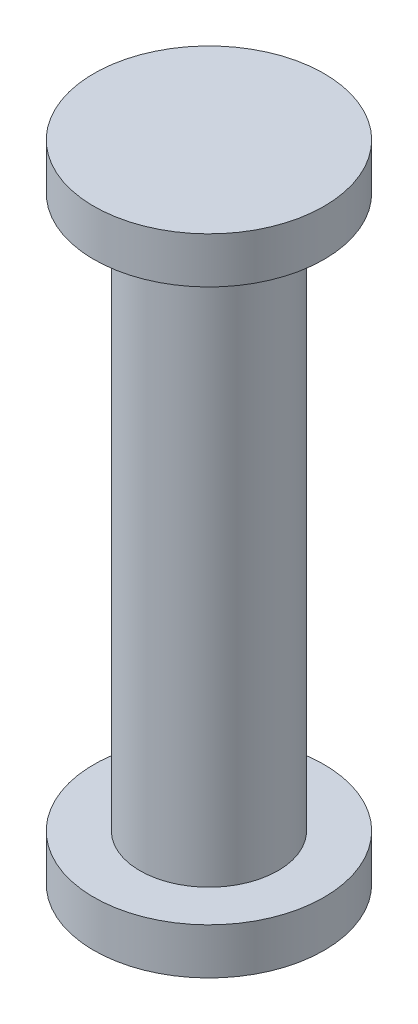
ISO-10303-21;
HEADER;
FILE_DESCRIPTION(('STEP AP214'),'2;1');
FILE_NAME('part.step','',(''),(''),'','','');
FILE_SCHEMA(('AUTOMOTIVE_DESIGN { 1 0 10303 214 1 1 1 1 }'));
ENDSEC;
DATA;
#1=APPLICATION_CONTEXT('core data for automotive mechanical design processes');
#2=APPLICATION_PROTOCOL_DEFINITION('international standard','automotive_design',2000,#1);
#3=PRODUCT_CONTEXT('',#1,'mechanical');
#4=PRODUCT('Part','Part','',(#3));
#5=PRODUCT_RELATED_PRODUCT_CATEGORY('part','',(#4));
#6=PRODUCT_DEFINITION_FORMATION('','',#4);
#7=PRODUCT_DEFINITION_CONTEXT('part definition',#1,'design');
#8=PRODUCT_DEFINITION('design','',#6,#7);
#9=PRODUCT_DEFINITION_SHAPE('','',#8);
#10=(LENGTH_UNIT() NAMED_UNIT(*) SI_UNIT(.MILLI.,.METRE.));
#11=(NAMED_UNIT(*) PLANE_ANGLE_UNIT() SI_UNIT($,.RADIAN.));
#12=(NAMED_UNIT(*) SI_UNIT($,.STERADIAN.) SOLID_ANGLE_UNIT());
#13=UNCERTAINTY_MEASURE_WITH_UNIT(LENGTH_MEASURE(1.E-05),#10,'distance_accuracy_value','');
#14=(GEOMETRIC_REPRESENTATION_CONTEXT(3) GLOBAL_UNCERTAINTY_ASSIGNED_CONTEXT((#13)) GLOBAL_UNIT_ASSIGNED_CONTEXT((#10,
#11,#12)) REPRESENTATION_CONTEXT('',''));
#15=CARTESIAN_POINT('',(0.,0.,0.));
#16=DIRECTION('',(0.,0.,1.));
#17=DIRECTION('',(1.,0.,0.));
#18=AXIS2_PLACEMENT_3D('',#15,#16,#17);
#19=CARTESIAN_POINT('',(-1.5,1.46913580246913,0.));
#20=DIRECTION('',(0.,-1.,0.));
#21=DIRECTION('',(-1.,0.,0.));
#22=AXIS2_PLACEMENT_3D('',#19,#20,#21);
#23=PLANE('',#22);
#24=CARTESIAN_POINT('',(0.,1.46913580246914,0.));
#25=DIRECTION('',(0.,1.,0.));
#26=DIRECTION('',(-1.,0.,0.));
#27=AXIS2_PLACEMENT_3D('',#24,#25,#26);
#28=CIRCLE('',#27,1.5);
#29=CARTESIAN_POINT('',(1.5,1.46913580246914,0.));
#30=VERTEX_POINT('',#29);
#31=EDGE_CURVE('E88',#30,#30,#28,.T.);
#32=ORIENTED_EDGE('',*,*,#31,.T.);
#33=EDGE_LOOP('',(#32));
#34=FACE_BOUND('',#33,.T.);
#35=CARTESIAN_POINT('',(0.,1.46913580246913,0.));
#36=DIRECTION('',(0.,1.,0.));
#37=DIRECTION('',(-1.,0.,0.));
#38=AXIS2_PLACEMENT_3D('',#35,#36,#37);
#39=CIRCLE('',#38,2.5);
#40=CARTESIAN_POINT('',(2.5,1.46913580246913,0.));
#41=VERTEX_POINT('',#40);
#42=EDGE_CURVE('E65',#41,#41,#39,.T.);
#43=ORIENTED_EDGE('',*,*,#42,.F.);
#44=EDGE_LOOP('',(#43));
#45=FACE_BOUND('',#44,.T.);
#46=ADVANCED_FACE('F17',(#34,#45),#23,.T.);
#47=CARTESIAN_POINT('',(-2.5,2.46913580246914,0.));
#48=DIRECTION('',(0.,1.,0.));
#49=DIRECTION('',(1.,0.,0.));
#50=AXIS2_PLACEMENT_3D('',#47,#48,#49);
#51=PLANE('',#50);
#52=CARTESIAN_POINT('',(0.,2.46913580246913,0.));
#53=DIRECTION('',(0.,1.,0.));
#54=DIRECTION('',(-1.,0.,0.));
#55=AXIS2_PLACEMENT_3D('',#52,#53,#54);
#56=CIRCLE('',#55,2.5);
#57=CARTESIAN_POINT('',(2.5,2.46913580246913,0.));
#58=VERTEX_POINT('',#57);
#59=EDGE_CURVE('E63',#58,#58,#56,.T.);
#60=ORIENTED_EDGE('',*,*,#59,.T.);
#61=EDGE_LOOP('',(#60));
#62=FACE_BOUND('',#61,.T.);
#63=ADVANCED_FACE('F69',(#62),#51,.T.);
#64=CARTESIAN_POINT('',(0.,-11.5308641975309,0.));
#65=DIRECTION('',(0.,-1.,0.));
#66=DIRECTION('',(-1.,0.,0.));
#67=AXIS2_PLACEMENT_3D('',#64,#65,#66);
#68=PLANE('',#67);
#69=CARTESIAN_POINT('',(0.,-11.5308641975309,0.));
#70=DIRECTION('',(0.,1.,0.));
#71=DIRECTION('',(-1.,0.,0.));
#72=AXIS2_PLACEMENT_3D('',#69,#70,#71);
#73=CIRCLE('',#72,2.5);
#74=CARTESIAN_POINT('',(2.5,-11.5308641975309,0.));
#75=VERTEX_POINT('',#74);
#76=EDGE_CURVE('E85',#75,#75,#73,.T.);
#77=ORIENTED_EDGE('',*,*,#76,.F.);
#78=EDGE_LOOP('',(#77));
#79=FACE_BOUND('',#78,.T.);
#80=ADVANCED_FACE('F107',(#79),#68,.T.);
#81=CARTESIAN_POINT('',(-2.5,-10.5308641975309,0.));
#82=DIRECTION('',(0.,1.,0.));
#83=DIRECTION('',(1.,0.,0.));
#84=AXIS2_PLACEMENT_3D('',#81,#82,#83);
#85=PLANE('',#84);
#86=CARTESIAN_POINT('',(0.,-10.5308641975309,0.));
#87=DIRECTION('',(0.,1.,0.));
#88=DIRECTION('',(-1.,0.,0.));
#89=AXIS2_PLACEMENT_3D('',#86,#87,#88);
#90=CIRCLE('',#89,1.5);
#91=CARTESIAN_POINT('',(1.5,-10.5308641975309,0.));
#92=VERTEX_POINT('',#91);
#93=EDGE_CURVE('E11',#92,#92,#90,.T.);
#94=ORIENTED_EDGE('',*,*,#93,.F.);
#95=EDGE_LOOP('',(#94));
#96=FACE_BOUND('',#95,.T.);
#97=CARTESIAN_POINT('',(0.,-10.5308641975309,0.));
#98=DIRECTION('',(0.,1.,0.));
#99=DIRECTION('',(-1.,0.,0.));
#100=AXIS2_PLACEMENT_3D('',#97,#98,#99);
#101=CIRCLE('',#100,2.5);
#102=CARTESIAN_POINT('',(2.5,-10.5308641975309,0.));
#103=VERTEX_POINT('',#102);
#104=EDGE_CURVE('E77',#103,#103,#101,.T.);
#105=ORIENTED_EDGE('',*,*,#104,.T.);
#106=EDGE_LOOP('',(#105));
#107=FACE_BOUND('',#106,.T.);
#108=ADVANCED_FACE('F97',(#96,#107),#85,.T.);
#109=CARTESIAN_POINT('',(0.,2.46913580246914,0.));
#110=DIRECTION('',(0.,1.,0.));
#111=DIRECTION('',(-1.,0.,0.));
#112=AXIS2_PLACEMENT_3D('',#109,#110,#111);
#113=CYLINDRICAL_SURFACE('',#112,1.5);
#114=ORIENTED_EDGE('',*,*,#31,.F.);
#115=DIRECTION('',(0.,-1.,0.));
#116=VECTOR('',#115,1.);
#117=CARTESIAN_POINT('',(1.5,2.46913580246914,0.));
#118=LINE('',#117,#116);
#119=EDGE_CURVE('E25',#30,#92,#118,.T.);
#120=ORIENTED_EDGE('',*,*,#119,.T.);
#121=ORIENTED_EDGE('',*,*,#93,.T.);
#122=ORIENTED_EDGE('',*,*,#119,.F.);
#123=EDGE_LOOP('',(#114,#120,#121,#122));
#124=FACE_BOUND('',#123,.T.);
#125=ADVANCED_FACE('F94',(#124),#113,.T.);
#126=CARTESIAN_POINT('',(0.,2.46913580246914,0.));
#127=DIRECTION('',(0.,1.,0.));
#128=DIRECTION('',(-1.,0.,0.));
#129=AXIS2_PLACEMENT_3D('',#126,#127,#128);
#130=CYLINDRICAL_SURFACE('',#129,2.5);
#131=ORIENTED_EDGE('',*,*,#104,.F.);
#132=DIRECTION('',(0.,-1.,0.));
#133=VECTOR('',#132,1.);
#134=CARTESIAN_POINT('',(2.5,2.46913580246914,0.));
#135=LINE('',#134,#133);
#136=EDGE_CURVE('E81',#103,#75,#135,.T.);
#137=ORIENTED_EDGE('',*,*,#136,.T.);
#138=ORIENTED_EDGE('',*,*,#76,.T.);
#139=ORIENTED_EDGE('',*,*,#136,.F.);
#140=EDGE_LOOP('',(#131,#137,#138,#139));
#141=FACE_BOUND('',#140,.T.);
#142=ADVANCED_FACE('F96',(#141),#130,.T.);
#143=CARTESIAN_POINT('',(0.,2.46913580246914,0.));
#144=DIRECTION('',(0.,1.,0.));
#145=DIRECTION('',(-1.,0.,0.));
#146=AXIS2_PLACEMENT_3D('',#143,#144,#145);
#147=CYLINDRICAL_SURFACE('',#146,2.5);
#148=ORIENTED_EDGE('',*,*,#59,.F.);
#149=DIRECTION('',(0.,-1.,0.));
#150=VECTOR('',#149,1.);
#151=CARTESIAN_POINT('',(2.5,2.46913580246914,0.));
#152=LINE('',#151,#150);
#153=EDGE_CURVE('E60',#58,#41,#152,.T.);
#154=ORIENTED_EDGE('',*,*,#153,.T.);
#155=ORIENTED_EDGE('',*,*,#42,.T.);
#156=ORIENTED_EDGE('',*,*,#153,.F.);
#157=EDGE_LOOP('',(#148,#154,#155,#156));
#158=FACE_BOUND('',#157,.T.);
#159=ADVANCED_FACE('F62',(#158),#147,.T.);
#160=CLOSED_SHELL('',(#46,#63,#80,#108,#125,#142,#159));
#161=MANIFOLD_SOLID_BREP('B1',#160);
#162=ADVANCED_BREP_SHAPE_REPRESENTATION('',(#18,#161),#14);
#163=SHAPE_DEFINITION_REPRESENTATION(#9,#162);
ENDSEC;
END-ISO-10303-21;
